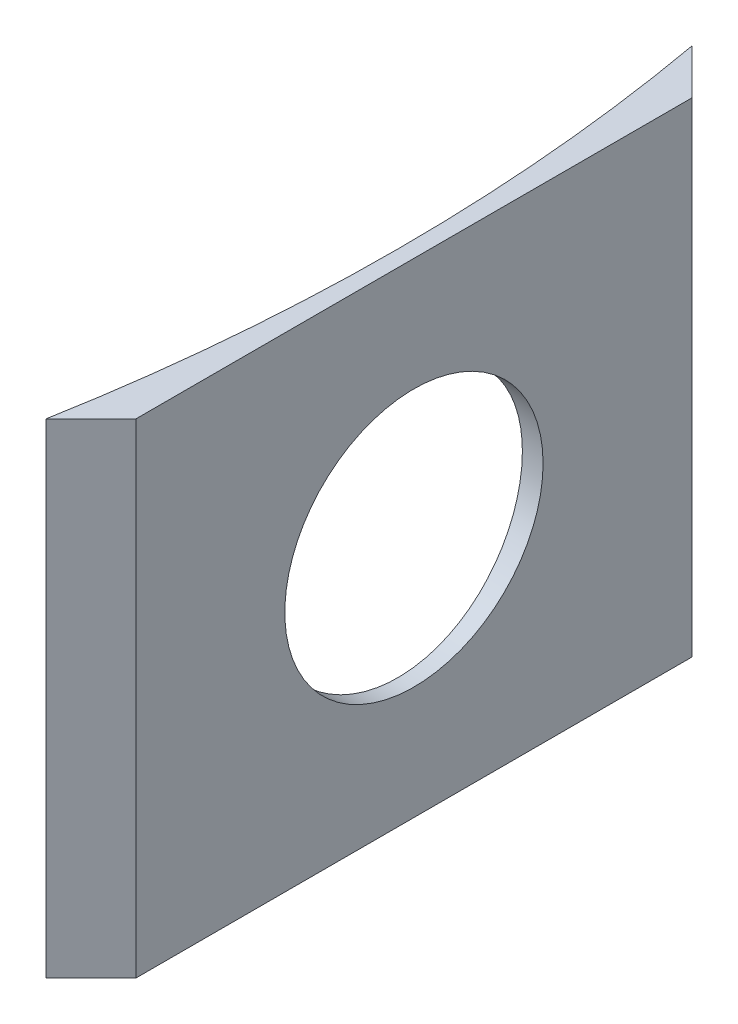
ISO-10303-21;
HEADER;
FILE_DESCRIPTION(('STEP AP214'),'2;1');
FILE_NAME('part.step','',(''),(''),'','','');
FILE_SCHEMA(('AUTOMOTIVE_DESIGN { 1 0 10303 214 1 1 1 1 }'));
ENDSEC;
DATA;
#1=APPLICATION_CONTEXT('core data for automotive mechanical design processes');
#2=APPLICATION_PROTOCOL_DEFINITION('international standard','automotive_design',2000,#1);
#3=PRODUCT_CONTEXT('',#1,'mechanical');
#4=PRODUCT('Part','Part','',(#3));
#5=PRODUCT_RELATED_PRODUCT_CATEGORY('part','',(#4));
#6=PRODUCT_DEFINITION_FORMATION('','',#4);
#7=PRODUCT_DEFINITION_CONTEXT('part definition',#1,'design');
#8=PRODUCT_DEFINITION('design','',#6,#7);
#9=PRODUCT_DEFINITION_SHAPE('','',#8);
#10=(LENGTH_UNIT() NAMED_UNIT(*) SI_UNIT(.MILLI.,.METRE.));
#11=(NAMED_UNIT(*) PLANE_ANGLE_UNIT() SI_UNIT($,.RADIAN.));
#12=(NAMED_UNIT(*) SI_UNIT($,.STERADIAN.) SOLID_ANGLE_UNIT());
#13=UNCERTAINTY_MEASURE_WITH_UNIT(LENGTH_MEASURE(1.E-05),#10,'distance_accuracy_value','');
#14=(GEOMETRIC_REPRESENTATION_CONTEXT(3) GLOBAL_UNCERTAINTY_ASSIGNED_CONTEXT((#13)) GLOBAL_UNIT_ASSIGNED_CONTEXT((#10,
#11,#12)) REPRESENTATION_CONTEXT('',''));
#15=CARTESIAN_POINT('',(0.,0.,0.));
#16=DIRECTION('',(0.,0.,1.));
#17=DIRECTION('',(1.,0.,0.));
#18=AXIS2_PLACEMENT_3D('',#15,#16,#17);
#19=CARTESIAN_POINT('',(0.,15.,0.));
#20=DIRECTION('',(0.,-1.,0.));
#21=DIRECTION('',(0.,0.,-1.));
#22=AXIS2_PLACEMENT_3D('',#19,#20,#21);
#23=CYLINDRICAL_SURFACE('',#22,56.5);
#24=CARTESIAN_POINT('',(56.3582292127778,7.5,-3.9999999999999));
#25=CARTESIAN_POINT('',(56.3582311026715,7.27562051933556,-3.99999015164007));
#26=CARTESIAN_POINT('',(56.3595836133368,7.05108551234811,-3.98105672228375));
#27=CARTESIAN_POINT('',(56.3648479054617,6.60822005755523,-3.90580188143685));
#28=CARTESIAN_POINT('',(56.3687626369699,6.38989706475464,-3.84943737205608));
#29=CARTESIAN_POINT('',(56.3787057476671,5.96593441777419,-3.70095155097055));
#30=CARTESIAN_POINT('',(56.384732980934,5.76028795820842,-3.60884962205895));
#31=CARTESIAN_POINT('',(56.3982205274761,5.36742563109372,-3.3915359353182));
#32=CARTESIAN_POINT('',(56.4056805204431,5.18020565823559,-3.26633157552825));
#33=CARTESIAN_POINT('',(56.4212089214014,4.82910487100937,-2.98610944678063));
#34=CARTESIAN_POINT('',(56.4292783255431,4.66526359224022,-2.83104219314656));
#35=CARTESIAN_POINT('',(56.4451071172978,4.36590996884764,-2.49559942632837));
#36=CARTESIAN_POINT('',(56.4528664917478,4.23039882600846,-2.31522284004678));
#37=CARTESIAN_POINT('',(56.4672099112743,3.99142627275608,-1.93405298761423));
#38=CARTESIAN_POINT('',(56.4737927302124,3.88799821589825,-1.73323876053548));
#39=CARTESIAN_POINT('',(56.48503071978,3.71634121891989,-1.31704070283381));
#40=CARTESIAN_POINT('',(56.4896859158058,3.64811181505595,-1.10165706420566));
#41=CARTESIAN_POINT('',(56.4965372220715,3.54890036724128,-0.662820553123312));
#42=CARTESIAN_POINT('',(56.4987374790443,3.51785550689038,-0.439381947859573));
#43=CARTESIAN_POINT('',(56.5004449963136,3.49370033302532,0.00954488425408613));
#44=CARTESIAN_POINT('',(56.4999522941551,3.50058949064086,0.235033082485135));
#45=CARTESIAN_POINT('',(56.4963328534305,3.55205514982717,0.68123267981723));
#46=CARTESIAN_POINT('',(56.4932108368517,3.59656409052475,0.901951915159037));
#47=CARTESIAN_POINT('',(56.484689565529,3.72190095064084,1.33277864493556));
#48=CARTESIAN_POINT('',(56.4792902942973,3.80272913301835,1.54288606252622));
#49=CARTESIAN_POINT('',(56.4668141175276,3.99848612715797,1.94674118277134));
#50=CARTESIAN_POINT('',(56.4597357133093,4.11344542523145,2.14047405990373));
#51=CARTESIAN_POINT('',(56.4446974714403,4.37417922131618,2.50591886964861));
#52=CARTESIAN_POINT('',(56.4367376209703,4.51995416751568,2.67763048192155));
#53=CARTESIAN_POINT('',(56.4208112361498,4.83856252650947,2.99455307882123));
#54=CARTESIAN_POINT('',(56.4128447254502,5.0114546033406,3.13970509506184));
#55=CARTESIAN_POINT('',(56.3978205928316,5.37918432332137,3.39893318026731));
#56=CARTESIAN_POINT('',(56.390762971395,5.57402197811867,3.51300923273843));
#57=CARTESIAN_POINT('',(56.3783539160636,5.98015104279456,3.7068437041538));
#58=CARTESIAN_POINT('',(56.3730026160877,6.19144374251187,3.78659942967434));
#59=CARTESIAN_POINT('',(56.3646142033967,6.62446695969849,3.90948749416799));
#60=CARTESIAN_POINT('',(56.3615770556924,6.84619731929984,3.952620386868));
#61=CARTESIAN_POINT('',(56.3581660566826,7.29328678498692,4.00096450482739));
#62=CARTESIAN_POINT('',(56.3577864418669,7.51863697525704,4.006257795048));
#63=CARTESIAN_POINT('',(56.3597182526255,7.96702182241503,3.97898706858981));
#64=CARTESIAN_POINT('',(56.3620296601691,8.19005649480733,3.94642330556264));
#65=CARTESIAN_POINT('',(56.3690777935213,8.62724582585272,3.84443109727224));
#66=CARTESIAN_POINT('',(56.3738120205778,8.84140938814172,3.77504063015863));
#67=CARTESIAN_POINT('',(56.3851702178267,9.25505236314199,3.60140327072445));
#68=CARTESIAN_POINT('',(56.3917942099897,9.45453160509696,3.49715597315006));
#69=CARTESIAN_POINT('',(56.4061995019629,9.83351990306451,3.25655518532228));
#70=CARTESIAN_POINT('',(56.4139827714639,10.012994043558,3.1201468166955));
#71=CARTESIAN_POINT('',(56.4298227673717,10.3465253798005,2.81917566576614));
#72=CARTESIAN_POINT('',(56.4378794971904,10.5005822582968,2.65461253209413));
#73=CARTESIAN_POINT('',(56.4533755531657,10.779184227407,2.30164947081905));
#74=CARTESIAN_POINT('',(56.4608137512911,10.9036761348829,2.1132075082502));
#75=CARTESIAN_POINT('',(56.4742184210967,11.1192500188222,1.718046625793));
#76=CARTESIAN_POINT('',(56.4801849039264,11.2103322483903,1.51132784438074));
#77=CARTESIAN_POINT('',(56.4899685712588,11.3564091997399,1.08567502465386));
#78=CARTESIAN_POINT('',(56.4937877431755,11.4114372987498,0.866752488355971));
#79=CARTESIAN_POINT('',(56.4988544504939,11.4839531224929,0.422747452004813));
#80=CARTESIAN_POINT('',(56.5001020196956,11.5014413406344,0.197665032953797));
#81=CARTESIAN_POINT('',(56.4998850404421,11.4983758823421,-0.251744941662667));
#82=CARTESIAN_POINT('',(56.4984264164444,11.477905306185,-0.476073071635171));
#83=CARTESIAN_POINT('',(56.4929727579541,11.3996760095521,-0.918097869803021));
#84=CARTESIAN_POINT('',(56.4889777193205,11.3419172281984,-1.13579452717104));
#85=CARTESIAN_POINT('',(56.4788999661541,11.190770788842,-1.55838646858719));
#86=CARTESIAN_POINT('',(56.4728172987078,11.0973839344264,-1.76328204124103));
#87=CARTESIAN_POINT('',(56.4592463407431,10.8776427925314,-2.15449821781236));
#88=CARTESIAN_POINT('',(56.4517580814708,10.7512892378731,-2.34081923449878));
#89=CARTESIAN_POINT('',(56.4361980891993,10.468891486664,-2.69002085218479));
#90=CARTESIAN_POINT('',(56.4281251825772,10.3127864817733,-2.85285222436053));
#91=CARTESIAN_POINT('',(56.4123154975818,9.97541291454738,-3.15005933121071));
#92=CARTESIAN_POINT('',(56.4045788016242,9.7941382275079,-3.28442811973735));
#93=CARTESIAN_POINT('',(56.3903049961292,9.41131192093876,-3.52102478359026));
#94=CARTESIAN_POINT('',(56.3837696637628,9.20973093351214,-3.62320519965163));
#95=CARTESIAN_POINT('',(56.3726608210622,8.79237093303991,-3.79214270713356));
#96=CARTESIAN_POINT('',(56.3680850295255,8.57660876856934,-3.85894101028461));
#97=CARTESIAN_POINT('',(56.3626044478093,8.21628608616461,-3.93798309908164));
#98=CARTESIAN_POINT('',(56.3609711425374,8.0740506569374,-3.96120905950214));
#99=CARTESIAN_POINT('',(56.3587829196553,7.78789816294285,-3.99222065552672));
#100=CARTESIAN_POINT('',(56.3582280000601,7.64398110127135,-4.00000631955144));
#101=CARTESIAN_POINT('',(56.3582292127778,7.5,-3.9999999999999));
#102=B_SPLINE_CURVE_WITH_KNOTS('',3,(#24,#25,#26,#27,#28,#29,#30,#31,#32,#33,#34,#35,#36,#37,
#38,#39,#40,#41,#42,#43,#44,#45,#46,#47,#48,#49,#50,#51,#52,#53,#54,#55,#56,#57,#58,#59,#60,#61,
#62,#63,#64,#65,#66,#67,#68,#69,#70,#71,#72,#73,#74,#75,#76,#77,#78,#79,#80,#81,#82,#83,#84,#85,
#86,#87,#88,#89,#90,#91,#92,#93,#94,#95,#96,#97,#98,#99,#100,#101),.UNSPECIFIED.,.T.,.F.,(4,2,2,
2,2,2,2,2,2,2,2,2,2,2,2,2,2,2,2,2,2,2,2,2,2,2,2,2,2,2,2,2,2,2,2,2,2,2,4),(0.,0.672612792515105,
1.34600137265042,2.01902523846938,2.69189881761396,3.36589713637455,4.03992404081809,
4.71464933280664,5.38936573504046,6.06294071400205,6.7365063021078,7.40886480656302,
8.08122817911449,8.75419393058894,9.42716947047006,10.1016215051506,10.7760738977996,
11.4505792111249,12.1250743259383,12.7981061786793,13.4711335219662,14.1434681394894,
14.8158105740067,15.4893086778083,16.1628151874304,16.8375242139326,17.512228128875,
18.1863065486166,18.8603761085044,19.5329717215259,20.2055684326481,20.8781499743259,
21.5507165663766,22.2246728377034,22.8987933955947,23.5739032897195,24.2482251028607,
24.6798318993788,25.1114379014461),.UNSPECIFIED.);
#103=CARTESIAN_POINT('',(56.3582292127778,7.5,-3.9999999999999));
#104=VERTEX_POINT('',#103);
#105=EDGE_CURVE('E115',#104,#104,#102,.T.);
#106=ORIENTED_EDGE('',*,*,#105,.F.);
#107=EDGE_LOOP('',(#106));
#108=FACE_BOUND('',#107,.T.);
#109=CARTESIAN_POINT('',(0.,0.,0.));
#110=DIRECTION('',(0.,1.,0.));
#111=DIRECTION('',(0.,0.,1.));
#112=AXIS2_PLACEMENT_3D('',#109,#110,#111);
#113=CIRCLE('',#112,56.5);
#114=CARTESIAN_POINT('',(55.6080030211479,0.,10.0000000000002));
#115=VERTEX_POINT('',#114);
#116=CARTESIAN_POINT('',(55.608003021148,0.,-9.99999999999979));
#117=VERTEX_POINT('',#116);
#118=EDGE_CURVE('E113',#115,#117,#113,.T.);
#119=ORIENTED_EDGE('',*,*,#118,.F.);
#120=DIRECTION('',(0.,-1.,0.));
#121=VECTOR('',#120,1.);
#122=CARTESIAN_POINT('',(55.6080030211479,15.,10.0000000000002));
#123=LINE('',#122,#121);
#124=CARTESIAN_POINT('',(55.6080030211479,15.,10.0000000000002));
#125=VERTEX_POINT('',#124);
#126=EDGE_CURVE('E13',#125,#115,#123,.T.);
#127=ORIENTED_EDGE('',*,*,#126,.F.);
#128=CARTESIAN_POINT('',(0.,15.,0.));
#129=DIRECTION('',(0.,1.,0.));
#130=DIRECTION('',(0.,0.,1.));
#131=AXIS2_PLACEMENT_3D('',#128,#129,#130);
#132=CIRCLE('',#131,56.5);
#133=CARTESIAN_POINT('',(55.608003021148,15.,-9.99999999999979));
#134=VERTEX_POINT('',#133);
#135=EDGE_CURVE('E105',#125,#134,#132,.T.);
#136=ORIENTED_EDGE('',*,*,#135,.T.);
#137=DIRECTION('',(0.,-1.,0.));
#138=VECTOR('',#137,1.);
#139=CARTESIAN_POINT('',(55.608003021148,15.,-9.99999999999979));
#140=LINE('',#139,#138);
#141=EDGE_CURVE('E65',#134,#117,#140,.T.);
#142=ORIENTED_EDGE('',*,*,#141,.T.);
#143=EDGE_LOOP('',(#119,#127,#136,#142));
#144=FACE_BOUND('',#143,.T.);
#145=ADVANCED_FACE('F47',(#108,#144),#23,.F.);
#146=CARTESIAN_POINT('',(32.8040015105739,15.,32.8040015105741));
#147=DIRECTION('',(0.707106781186546,0.,0.707106781186549));
#148=DIRECTION('',(0.707106781186549,0.,-0.707106781186546));
#149=AXIS2_PLACEMENT_3D('',#146,#147,#148);
#150=PLANE('',#149);
#151=DIRECTION('',(-0.707106781186549,0.,0.707106781186546));
#152=VECTOR('',#151,1.);
#153=CARTESIAN_POINT('',(32.8040015105739,0.,32.8040015105741));
#154=LINE('',#153,#152);
#155=CARTESIAN_POINT('',(57.,0.,8.60800302114813));
#156=VERTEX_POINT('',#155);
#157=EDGE_CURVE('E95',#156,#115,#154,.T.);
#158=ORIENTED_EDGE('',*,*,#157,.F.);
#159=DIRECTION('',(0.,-1.,0.));
#160=VECTOR('',#159,1.);
#161=CARTESIAN_POINT('',(57.,15.,8.60800302114813));
#162=LINE('',#161,#160);
#163=CARTESIAN_POINT('',(57.,15.,8.60800302114813));
#164=VERTEX_POINT('',#163);
#165=EDGE_CURVE('E57',#164,#156,#162,.T.);
#166=ORIENTED_EDGE('',*,*,#165,.F.);
#167=DIRECTION('',(-0.707106781186549,0.,0.707106781186546));
#168=VECTOR('',#167,1.);
#169=CARTESIAN_POINT('',(32.8040015105739,15.,32.8040015105741));
#170=LINE('',#169,#168);
#171=EDGE_CURVE('E93',#164,#125,#170,.T.);
#172=ORIENTED_EDGE('',*,*,#171,.T.);
#173=ORIENTED_EDGE('',*,*,#126,.T.);
#174=EDGE_LOOP('',(#158,#166,#172,#173));
#175=FACE_BOUND('',#174,.T.);
#176=ADVANCED_FACE('F92',(#175),#150,.T.);
#177=CARTESIAN_POINT('',(57.,15.,0.));
#178=DIRECTION('',(1.,0.,0.));
#179=DIRECTION('',(0.,0.,-1.));
#180=AXIS2_PLACEMENT_3D('',#177,#178,#179);
#181=PLANE('',#180);
#182=CARTESIAN_POINT('',(57.,7.5,1.04083408558608E-13));
#183=DIRECTION('',(1.,0.,0.));
#184=DIRECTION('',(0.,0.,-1.));
#185=AXIS2_PLACEMENT_3D('',#182,#183,#184);
#186=CIRCLE('',#185,4.);
#187=CARTESIAN_POINT('',(57.,7.5,-3.9999999999999));
#188=VERTEX_POINT('',#187);
#189=EDGE_CURVE('E51',#188,#188,#186,.T.);
#190=ORIENTED_EDGE('',*,*,#189,.F.);
#191=EDGE_LOOP('',(#190));
#192=FACE_BOUND('',#191,.T.);
#193=DIRECTION('',(0.,0.,1.));
#194=VECTOR('',#193,1.);
#195=CARTESIAN_POINT('',(57.,0.,0.));
#196=LINE('',#195,#194);
#197=CARTESIAN_POINT('',(57.,0.,-8.60800302114779));
#198=VERTEX_POINT('',#197);
#199=EDGE_CURVE('E117',#198,#156,#196,.T.);
#200=ORIENTED_EDGE('',*,*,#199,.F.);
#201=DIRECTION('',(0.,-1.,0.));
#202=VECTOR('',#201,1.);
#203=CARTESIAN_POINT('',(57.,15.,-8.60800302114779));
#204=LINE('',#203,#202);
#205=CARTESIAN_POINT('',(57.,15.,-8.60800302114779));
#206=VERTEX_POINT('',#205);
#207=EDGE_CURVE('E78',#206,#198,#204,.T.);
#208=ORIENTED_EDGE('',*,*,#207,.F.);
#209=DIRECTION('',(0.,0.,1.));
#210=VECTOR('',#209,1.);
#211=CARTESIAN_POINT('',(57.,15.,0.));
#212=LINE('',#211,#210);
#213=EDGE_CURVE('E104',#206,#164,#212,.T.);
#214=ORIENTED_EDGE('',*,*,#213,.T.);
#215=ORIENTED_EDGE('',*,*,#165,.T.);
#216=EDGE_LOOP('',(#200,#208,#214,#215));
#217=FACE_BOUND('',#216,.T.);
#218=ADVANCED_FACE('F107',(#192,#217),#181,.T.);
#219=CARTESIAN_POINT('',(32.8040015105735,15.,-32.804001510574));
#220=DIRECTION('',(0.707106781186543,0.,-0.707106781186552));
#221=DIRECTION('',(-0.707106781186552,0.,-0.707106781186543));
#222=AXIS2_PLACEMENT_3D('',#219,#220,#221);
#223=PLANE('',#222);
#224=DIRECTION('',(0.707106781186552,0.,0.707106781186543));
#225=VECTOR('',#224,1.);
#226=CARTESIAN_POINT('',(32.8040015105735,0.,-32.804001510574));
#227=LINE('',#226,#225);
#228=EDGE_CURVE('E119',#117,#198,#227,.T.);
#229=ORIENTED_EDGE('',*,*,#228,.F.);
#230=ORIENTED_EDGE('',*,*,#141,.F.);
#231=DIRECTION('',(0.707106781186552,0.,0.707106781186543));
#232=VECTOR('',#231,1.);
#233=CARTESIAN_POINT('',(32.8040015105735,15.,-32.804001510574));
#234=LINE('',#233,#232);
#235=EDGE_CURVE('E108',#134,#206,#234,.T.);
#236=ORIENTED_EDGE('',*,*,#235,.T.);
#237=ORIENTED_EDGE('',*,*,#207,.T.);
#238=EDGE_LOOP('',(#229,#230,#236,#237));
#239=FACE_BOUND('',#238,.T.);
#240=ADVANCED_FACE('F138',(#239),#223,.T.);
#241=CARTESIAN_POINT('',(0.,15.,0.));
#242=DIRECTION('',(0.,1.,0.));
#243=DIRECTION('',(0.,0.,1.));
#244=AXIS2_PLACEMENT_3D('',#241,#242,#243);
#245=PLANE('',#244);
#246=ORIENTED_EDGE('',*,*,#135,.F.);
#247=ORIENTED_EDGE('',*,*,#171,.F.);
#248=ORIENTED_EDGE('',*,*,#213,.F.);
#249=ORIENTED_EDGE('',*,*,#235,.F.);
#250=EDGE_LOOP('',(#246,#247,#248,#249));
#251=FACE_BOUND('',#250,.T.);
#252=ADVANCED_FACE('F102',(#251),#245,.T.);
#253=CARTESIAN_POINT('',(0.,0.,0.));
#254=DIRECTION('',(0.,1.,0.));
#255=DIRECTION('',(0.,0.,1.));
#256=AXIS2_PLACEMENT_3D('',#253,#254,#255);
#257=PLANE('',#256);
#258=ORIENTED_EDGE('',*,*,#118,.T.);
#259=ORIENTED_EDGE('',*,*,#228,.T.);
#260=ORIENTED_EDGE('',*,*,#199,.T.);
#261=ORIENTED_EDGE('',*,*,#157,.T.);
#262=EDGE_LOOP('',(#258,#259,#260,#261));
#263=FACE_BOUND('',#262,.T.);
#264=ADVANCED_FACE('F134',(#263),#257,.F.);
#265=CARTESIAN_POINT('',(42.,7.5,1.04083408558608E-13));
#266=DIRECTION('',(1.,0.,0.));
#267=DIRECTION('',(0.,0.,-1.));
#268=AXIS2_PLACEMENT_3D('',#265,#266,#267);
#269=CYLINDRICAL_SURFACE('',#268,4.);
#270=ORIENTED_EDGE('',*,*,#105,.T.);
#271=EDGE_LOOP('',(#270));
#272=FACE_BOUND('',#271,.T.);
#273=ORIENTED_EDGE('',*,*,#189,.T.);
#274=EDGE_LOOP('',(#273));
#275=FACE_BOUND('',#274,.T.);
#276=ADVANCED_FACE('F130',(#272,#275),#269,.F.);
#277=CLOSED_SHELL('',(#145,#176,#218,#240,#252,#264,#276));
#278=MANIFOLD_SOLID_BREP('B2',#277);
#279=ADVANCED_BREP_SHAPE_REPRESENTATION('',(#18,#278),#14);
#280=SHAPE_DEFINITION_REPRESENTATION(#9,#279);
ENDSEC;
END-ISO-10303-21;
